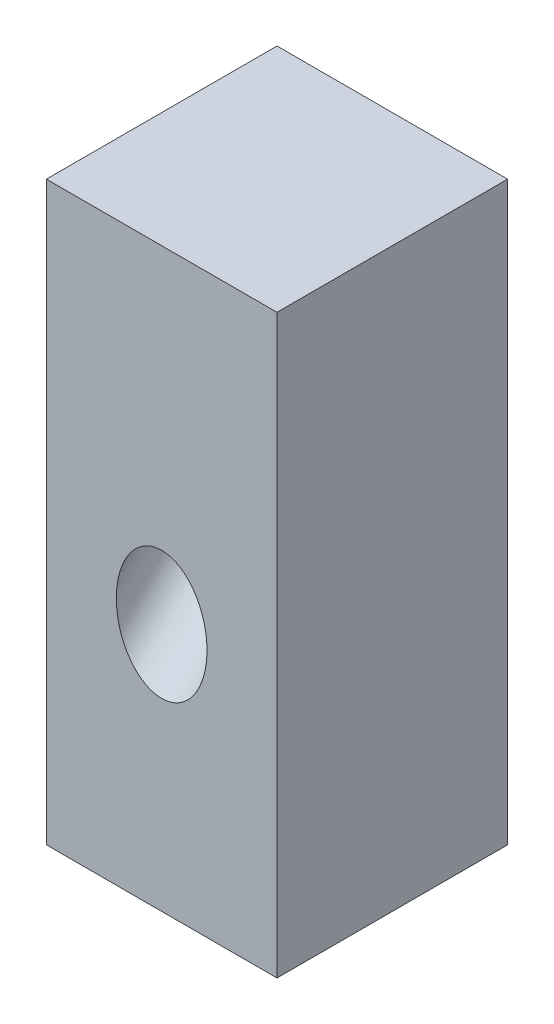
ISO-10303-21;
HEADER;
FILE_DESCRIPTION(('STEP AP214'),'2;1');
FILE_NAME('part.step','',(''),(''),'','','');
FILE_SCHEMA(('AUTOMOTIVE_DESIGN { 1 0 10303 214 1 1 1 1 }'));
ENDSEC;
DATA;
#1=APPLICATION_CONTEXT('core data for automotive mechanical design processes');
#2=APPLICATION_PROTOCOL_DEFINITION('international standard','automotive_design',2000,#1);
#3=PRODUCT_CONTEXT('',#1,'mechanical');
#4=PRODUCT('Part','Part','',(#3));
#5=PRODUCT_RELATED_PRODUCT_CATEGORY('part','',(#4));
#6=PRODUCT_DEFINITION_FORMATION('','',#4);
#7=PRODUCT_DEFINITION_CONTEXT('part definition',#1,'design');
#8=PRODUCT_DEFINITION('design','',#6,#7);
#9=PRODUCT_DEFINITION_SHAPE('','',#8);
#10=(LENGTH_UNIT() NAMED_UNIT(*) SI_UNIT(.MILLI.,.METRE.));
#11=(NAMED_UNIT(*) PLANE_ANGLE_UNIT() SI_UNIT($,.RADIAN.));
#12=(NAMED_UNIT(*) SI_UNIT($,.STERADIAN.) SOLID_ANGLE_UNIT());
#13=UNCERTAINTY_MEASURE_WITH_UNIT(LENGTH_MEASURE(1.E-05),#10,'distance_accuracy_value','');
#14=(GEOMETRIC_REPRESENTATION_CONTEXT(3) GLOBAL_UNCERTAINTY_ASSIGNED_CONTEXT((#13)) GLOBAL_UNIT_ASSIGNED_CONTEXT((#10,
#11,#12)) REPRESENTATION_CONTEXT('',''));
#15=CARTESIAN_POINT('',(0.,0.,0.));
#16=DIRECTION('',(0.,0.,1.));
#17=DIRECTION('',(1.,0.,0.));
#18=AXIS2_PLACEMENT_3D('',#15,#16,#17);
#19=CARTESIAN_POINT('',(0.,-32.,0.));
#20=DIRECTION('',(-1.,0.,0.));
#21=DIRECTION('',(0.,0.,1.));
#22=AXIS2_PLACEMENT_3D('',#19,#20,#21);
#23=PLANE('',#22);
#24=DIRECTION('',(0.,1.,0.));
#25=VECTOR('',#24,1.);
#26=CARTESIAN_POINT('',(0.,-32.,0.));
#27=LINE('',#26,#25);
#28=CARTESIAN_POINT('',(0.,-32.,0.));
#29=VERTEX_POINT('',#28);
#30=CARTESIAN_POINT('',(0.,68.,0.));
#31=VERTEX_POINT('',#30);
#32=EDGE_CURVE('E78',#29,#31,#27,.T.);
#33=ORIENTED_EDGE('',*,*,#32,.T.);
#34=DIRECTION('',(0.,0.,1.));
#35=VECTOR('',#34,1.);
#36=CARTESIAN_POINT('',(0.,68.,0.));
#37=LINE('',#36,#35);
#38=CARTESIAN_POINT('',(0.,68.,-40.));
#39=VERTEX_POINT('',#38);
#40=EDGE_CURVE('E81',#39,#31,#37,.T.);
#41=ORIENTED_EDGE('',*,*,#40,.F.);
#42=DIRECTION('',(0.,1.,0.));
#43=VECTOR('',#42,1.);
#44=CARTESIAN_POINT('',(0.,-32.,-40.));
#45=LINE('',#44,#43);
#46=CARTESIAN_POINT('',(0.,-32.,-40.));
#47=VERTEX_POINT('',#46);
#48=EDGE_CURVE('E11',#47,#39,#45,.T.);
#49=ORIENTED_EDGE('',*,*,#48,.F.);
#50=DIRECTION('',(0.,0.,1.));
#51=VECTOR('',#50,1.);
#52=CARTESIAN_POINT('',(0.,-32.,0.));
#53=LINE('',#52,#51);
#54=EDGE_CURVE('E82',#47,#29,#53,.T.);
#55=ORIENTED_EDGE('',*,*,#54,.T.);
#56=EDGE_LOOP('',(#33,#41,#49,#55));
#57=FACE_BOUND('',#56,.T.);
#58=ADVANCED_FACE('F39',(#57),#23,.T.);
#59=CARTESIAN_POINT('',(0.,-32.,-40.));
#60=DIRECTION('',(0.,0.,-1.));
#61=DIRECTION('',(-1.,0.,0.));
#62=AXIS2_PLACEMENT_3D('',#59,#60,#61);
#63=PLANE('',#62);
#64=CARTESIAN_POINT('',(20.,51.1224775366926,-40.));
#65=DIRECTION('',(0.,0.,-1.));
#66=DIRECTION('',(0.,1.,0.));
#67=AXIS2_PLACEMENT_3D('',#64,#65,#66);
#68=ELLIPSE('',#67,11.5115331021214,8.13978591786795);
#69=CARTESIAN_POINT('',(20.,62.634010638814,-40.));
#70=VERTEX_POINT('',#69);
#71=EDGE_CURVE('E102',#70,#70,#68,.T.);
#72=ORIENTED_EDGE('',*,*,#71,.F.);
#73=EDGE_LOOP('',(#72));
#74=FACE_BOUND('',#73,.T.);
#75=ORIENTED_EDGE('',*,*,#48,.T.);
#76=DIRECTION('',(-1.,0.,0.));
#77=VECTOR('',#76,1.);
#78=CARTESIAN_POINT('',(0.,68.,-40.));
#79=LINE('',#78,#77);
#80=CARTESIAN_POINT('',(40.,68.,-40.));
#81=VERTEX_POINT('',#80);
#82=EDGE_CURVE('E100',#81,#39,#79,.T.);
#83=ORIENTED_EDGE('',*,*,#82,.F.);
#84=DIRECTION('',(0.,1.,0.));
#85=VECTOR('',#84,1.);
#86=CARTESIAN_POINT('',(40.,-32.,-40.));
#87=LINE('',#86,#85);
#88=CARTESIAN_POINT('',(40.,-32.,-40.));
#89=VERTEX_POINT('',#88);
#90=EDGE_CURVE('E48',#89,#81,#87,.T.);
#91=ORIENTED_EDGE('',*,*,#90,.F.);
#92=DIRECTION('',(-1.,0.,0.));
#93=VECTOR('',#92,1.);
#94=CARTESIAN_POINT('',(0.,-32.,-40.));
#95=LINE('',#94,#93);
#96=EDGE_CURVE('E88',#89,#47,#95,.T.);
#97=ORIENTED_EDGE('',*,*,#96,.T.);
#98=EDGE_LOOP('',(#75,#83,#91,#97));
#99=FACE_BOUND('',#98,.T.);
#100=ADVANCED_FACE('F141',(#74,#99),#63,.T.);
#101=CARTESIAN_POINT('',(40.,-32.,0.));
#102=DIRECTION('',(1.,0.,0.));
#103=DIRECTION('',(0.,0.,-1.));
#104=AXIS2_PLACEMENT_3D('',#101,#102,#103);
#105=PLANE('',#104);
#106=ORIENTED_EDGE('',*,*,#90,.T.);
#107=DIRECTION('',(0.,0.,-1.));
#108=VECTOR('',#107,1.);
#109=CARTESIAN_POINT('',(40.,68.,0.));
#110=LINE('',#109,#108);
#111=CARTESIAN_POINT('',(40.,68.,0.));
#112=VERTEX_POINT('',#111);
#113=EDGE_CURVE('E96',#112,#81,#110,.T.);
#114=ORIENTED_EDGE('',*,*,#113,.F.);
#115=DIRECTION('',(0.,1.,0.));
#116=VECTOR('',#115,1.);
#117=CARTESIAN_POINT('',(40.,-32.,0.));
#118=LINE('',#117,#116);
#119=CARTESIAN_POINT('',(40.,-32.,0.));
#120=VERTEX_POINT('',#119);
#121=EDGE_CURVE('E87',#120,#112,#118,.T.);
#122=ORIENTED_EDGE('',*,*,#121,.F.);
#123=DIRECTION('',(0.,0.,-1.));
#124=VECTOR('',#123,1.);
#125=CARTESIAN_POINT('',(40.,-32.,0.));
#126=LINE('',#125,#124);
#127=EDGE_CURVE('E118',#120,#89,#126,.T.);
#128=ORIENTED_EDGE('',*,*,#127,.T.);
#129=EDGE_LOOP('',(#106,#114,#122,#128));
#130=FACE_BOUND('',#129,.T.);
#131=ADVANCED_FACE('F138',(#130),#105,.T.);
#132=CARTESIAN_POINT('',(0.,-32.,0.));
#133=DIRECTION('',(0.,0.,1.));
#134=DIRECTION('',(1.,0.,0.));
#135=AXIS2_PLACEMENT_3D('',#132,#133,#134);
#136=PLANE('',#135);
#137=CARTESIAN_POINT('',(20.,11.1205669001859,0.));
#138=DIRECTION('',(0.,0.,1.));
#139=DIRECTION('',(0.,1.,0.));
#140=AXIS2_PLACEMENT_3D('',#137,#138,#139);
#141=ELLIPSE('',#140,11.1205669001859,7.86333436648511);
#142=CARTESIAN_POINT('',(20.,22.2411338003718,0.));
#143=VERTEX_POINT('',#142);
#144=EDGE_CURVE('E42',#143,#143,#141,.T.);
#145=ORIENTED_EDGE('',*,*,#144,.F.);
#146=EDGE_LOOP('',(#145));
#147=FACE_BOUND('',#146,.T.);
#148=ORIENTED_EDGE('',*,*,#121,.T.);
#149=DIRECTION('',(1.,0.,0.));
#150=VECTOR('',#149,1.);
#151=CARTESIAN_POINT('',(0.,68.,0.));
#152=LINE('',#151,#150);
#153=EDGE_CURVE('E90',#31,#112,#152,.T.);
#154=ORIENTED_EDGE('',*,*,#153,.F.);
#155=ORIENTED_EDGE('',*,*,#32,.F.);
#156=DIRECTION('',(1.,0.,0.));
#157=VECTOR('',#156,1.);
#158=CARTESIAN_POINT('',(0.,-32.,0.));
#159=LINE('',#158,#157);
#160=EDGE_CURVE('E115',#29,#120,#159,.T.);
#161=ORIENTED_EDGE('',*,*,#160,.T.);
#162=EDGE_LOOP('',(#148,#154,#155,#161));
#163=FACE_BOUND('',#162,.T.);
#164=ADVANCED_FACE('F91',(#147,#163),#136,.T.);
#165=CARTESIAN_POINT('',(0.,-32.,0.));
#166=DIRECTION('',(0.,-1.,0.));
#167=DIRECTION('',(0.,0.,-1.));
#168=AXIS2_PLACEMENT_3D('',#165,#166,#167);
#169=PLANE('',#168);
#170=ORIENTED_EDGE('',*,*,#54,.F.);
#171=ORIENTED_EDGE('',*,*,#96,.F.);
#172=ORIENTED_EDGE('',*,*,#127,.F.);
#173=ORIENTED_EDGE('',*,*,#160,.F.);
#174=EDGE_LOOP('',(#170,#171,#172,#173));
#175=FACE_BOUND('',#174,.T.);
#176=ADVANCED_FACE('F143',(#175),#169,.T.);
#177=CARTESIAN_POINT('',(0.,68.,0.));
#178=DIRECTION('',(0.,-1.,0.));
#179=DIRECTION('',(0.,0.,-1.));
#180=AXIS2_PLACEMENT_3D('',#177,#178,#179);
#181=PLANE('',#180);
#182=ORIENTED_EDGE('',*,*,#40,.T.);
#183=ORIENTED_EDGE('',*,*,#153,.T.);
#184=ORIENTED_EDGE('',*,*,#113,.T.);
#185=ORIENTED_EDGE('',*,*,#82,.T.);
#186=EDGE_LOOP('',(#182,#183,#184,#185));
#187=FACE_BOUND('',#186,.T.);
#188=ADVANCED_FACE('F99',(#187),#181,.F.);
#189=CARTESIAN_POINT('',(20.,5.53311056278473,5.53311056278475));
#190=DIRECTION('',(0.,0.707106781186549,-0.707106781186546));
#191=DIRECTION('',(0.,-0.707106781186546,-0.707106781186549));
#192=AXIS2_PLACEMENT_3D('',#189,#190,#191);
#193=CONICAL_SURFACE('',#192,7.825,0.00488692190558413);
#194=ORIENTED_EDGE('',*,*,#71,.T.);
#195=EDGE_LOOP('',(#194));
#196=FACE_BOUND('',#195,.T.);
#197=ORIENTED_EDGE('',*,*,#144,.T.);
#198=EDGE_LOOP('',(#197));
#199=FACE_BOUND('',#198,.T.);
#200=ADVANCED_FACE('F150',(#196,#199),#193,.F.);
#201=CLOSED_SHELL('',(#58,#100,#131,#164,#176,#188,#200));
#202=MANIFOLD_SOLID_BREP('B2',#201);
#203=ADVANCED_BREP_SHAPE_REPRESENTATION('',(#18,#202),#14);
#204=SHAPE_DEFINITION_REPRESENTATION(#9,#203);
ENDSEC;
END-ISO-10303-21;
